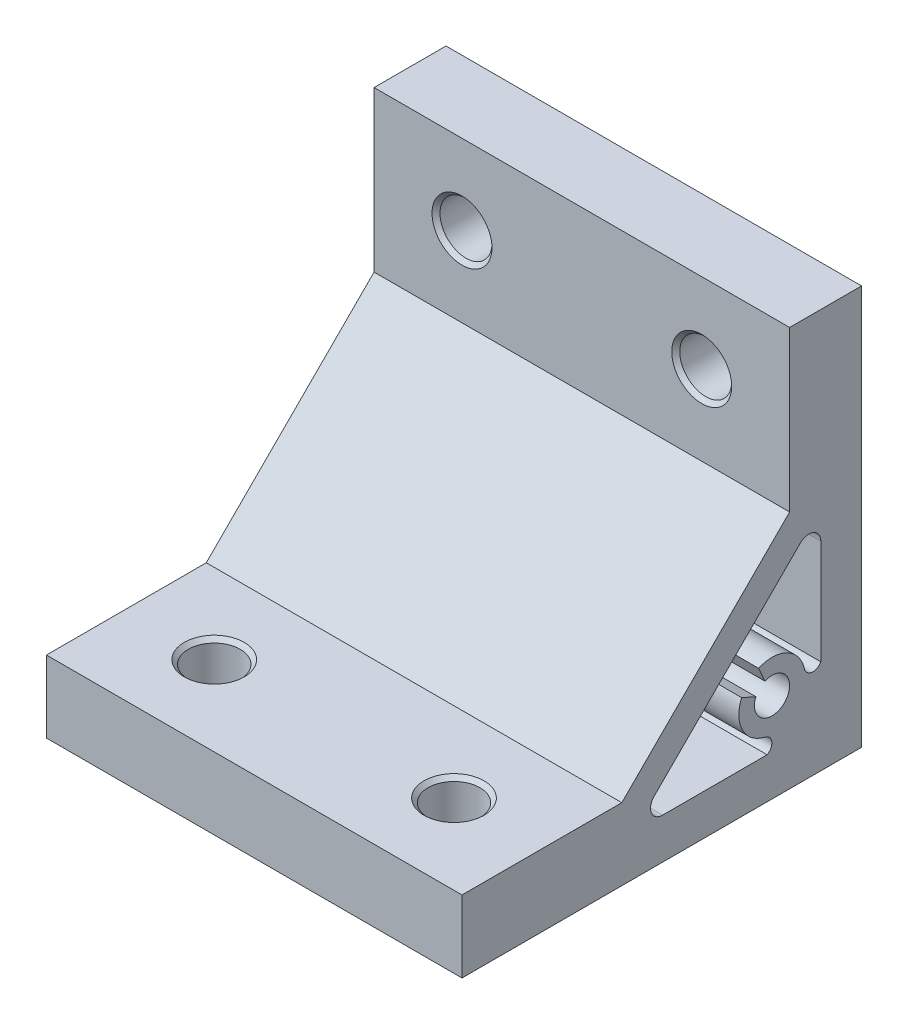
ISO-10303-21;
HEADER;
FILE_DESCRIPTION(('STEP AP214'),'2;1');
FILE_NAME('part.step','',(''),(''),'','','');
FILE_SCHEMA(('AUTOMOTIVE_DESIGN { 1 0 10303 214 1 1 1 1 }'));
ENDSEC;
DATA;
#1=APPLICATION_CONTEXT('core data for automotive mechanical design processes');
#2=APPLICATION_PROTOCOL_DEFINITION('international standard','automotive_design',2000,#1);
#3=PRODUCT_CONTEXT('',#1,'mechanical');
#4=PRODUCT('Part','Part','',(#3));
#5=PRODUCT_RELATED_PRODUCT_CATEGORY('part','',(#4));
#6=PRODUCT_DEFINITION_FORMATION('','',#4);
#7=PRODUCT_DEFINITION_CONTEXT('part definition',#1,'design');
#8=PRODUCT_DEFINITION('design','',#6,#7);
#9=PRODUCT_DEFINITION_SHAPE('','',#8);
#10=(LENGTH_UNIT() NAMED_UNIT(*) SI_UNIT(.MILLI.,.METRE.));
#11=(NAMED_UNIT(*) PLANE_ANGLE_UNIT() SI_UNIT($,.RADIAN.));
#12=(NAMED_UNIT(*) SI_UNIT($,.STERADIAN.) SOLID_ANGLE_UNIT());
#13=UNCERTAINTY_MEASURE_WITH_UNIT(LENGTH_MEASURE(1.E-05),#10,'distance_accuracy_value','');
#14=(GEOMETRIC_REPRESENTATION_CONTEXT(3) GLOBAL_UNCERTAINTY_ASSIGNED_CONTEXT((#13)) GLOBAL_UNIT_ASSIGNED_CONTEXT((#10,
#11,#12)) REPRESENTATION_CONTEXT('',''));
#15=CARTESIAN_POINT('',(0.,0.,0.));
#16=DIRECTION('',(0.,0.,1.));
#17=DIRECTION('',(1.,0.,0.));
#18=AXIS2_PLACEMENT_3D('',#15,#16,#17);
#19=CARTESIAN_POINT('',(15.,9.,25.));
#20=DIRECTION('',(0.,0.,-1.));
#21=DIRECTION('',(0.,1.,0.));
#22=AXIS2_PLACEMENT_3D('',#19,#20,#21);
#23=PLANE('',#22);
#24=DIRECTION('',(0.,-1.,0.));
#25=VECTOR('',#24,1.);
#26=CARTESIAN_POINT('',(-11.,50.,25.));
#27=LINE('',#26,#25);
#28=CARTESIAN_POINT('',(-11.,9.,25.));
#29=VERTEX_POINT('',#28);
#30=CARTESIAN_POINT('',(-11.,0.,25.));
#31=VERTEX_POINT('',#30);
#32=EDGE_CURVE('E39',#29,#31,#27,.T.);
#33=ORIENTED_EDGE('',*,*,#32,.T.);
#34=DIRECTION('',(-1.,0.,0.));
#35=VECTOR('',#34,1.);
#36=CARTESIAN_POINT('',(15.,0.,25.));
#37=LINE('',#36,#35);
#38=CARTESIAN_POINT('',(41.,0.,25.));
#39=VERTEX_POINT('',#38);
#40=EDGE_CURVE('E164',#39,#31,#37,.T.);
#41=ORIENTED_EDGE('',*,*,#40,.F.);
#42=DIRECTION('',(0.,1.,0.));
#43=VECTOR('',#42,1.);
#44=CARTESIAN_POINT('',(41.,50.,25.));
#45=LINE('',#44,#43);
#46=CARTESIAN_POINT('',(41.,9.,25.));
#47=VERTEX_POINT('',#46);
#48=EDGE_CURVE('E155',#39,#47,#45,.T.);
#49=ORIENTED_EDGE('',*,*,#48,.T.);
#50=DIRECTION('',(-1.,0.,0.));
#51=VECTOR('',#50,1.);
#52=CARTESIAN_POINT('',(15.,9.,25.));
#53=LINE('',#52,#51);
#54=EDGE_CURVE('E298',#47,#29,#53,.T.);
#55=ORIENTED_EDGE('',*,*,#54,.T.);
#56=EDGE_LOOP('',(#33,#41,#49,#55));
#57=FACE_BOUND('',#56,.T.);
#58=ADVANCED_FACE('F16',(#57),#23,.F.);
#59=CARTESIAN_POINT('',(15.,0.,25.));
#60=DIRECTION('',(0.,1.,0.));
#61=DIRECTION('',(0.,0.,1.));
#62=AXIS2_PLACEMENT_3D('',#59,#60,#61);
#63=PLANE('',#62);
#64=CARTESIAN_POINT('',(0.,0.,15.));
#65=DIRECTION('',(0.,1.,0.));
#66=DIRECTION('',(0.,0.,1.));
#67=AXIS2_PLACEMENT_3D('',#64,#65,#66);
#68=CIRCLE('',#67,3.75);
#69=CARTESIAN_POINT('',(0.,0.,18.75));
#70=VERTEX_POINT('',#69);
#71=EDGE_CURVE('E188',#70,#70,#68,.T.);
#72=ORIENTED_EDGE('',*,*,#71,.T.);
#73=EDGE_LOOP('',(#72));
#74=FACE_BOUND('',#73,.T.);
#75=CARTESIAN_POINT('',(30.,0.,15.));
#76=DIRECTION('',(0.,-1.,0.));
#77=DIRECTION('',(0.,0.,1.));
#78=AXIS2_PLACEMENT_3D('',#75,#76,#77);
#79=CIRCLE('',#78,3.75);
#80=CARTESIAN_POINT('',(30.,0.,18.75));
#81=VERTEX_POINT('',#80);
#82=EDGE_CURVE('E271',#81,#81,#79,.T.);
#83=ORIENTED_EDGE('',*,*,#82,.F.);
#84=EDGE_LOOP('',(#83));
#85=FACE_BOUND('',#84,.T.);
#86=DIRECTION('',(0.,0.,1.));
#87=VECTOR('',#86,1.);
#88=CARTESIAN_POINT('',(-11.,0.,-25.));
#89=LINE('',#88,#87);
#90=CARTESIAN_POINT('',(-11.,0.,-25.));
#91=VERTEX_POINT('',#90);
#92=EDGE_CURVE('E147',#91,#31,#89,.T.);
#93=ORIENTED_EDGE('',*,*,#92,.F.);
#94=DIRECTION('',(-1.,0.,0.));
#95=VECTOR('',#94,1.);
#96=CARTESIAN_POINT('',(15.,0.,-25.));
#97=LINE('',#96,#95);
#98=CARTESIAN_POINT('',(41.,0.,-25.));
#99=VERTEX_POINT('',#98);
#100=EDGE_CURVE('E162',#99,#91,#97,.T.);
#101=ORIENTED_EDGE('',*,*,#100,.F.);
#102=DIRECTION('',(0.,0.,1.));
#103=VECTOR('',#102,1.);
#104=CARTESIAN_POINT('',(41.,0.,-25.));
#105=LINE('',#104,#103);
#106=EDGE_CURVE('E165',#99,#39,#105,.T.);
#107=ORIENTED_EDGE('',*,*,#106,.T.);
#108=ORIENTED_EDGE('',*,*,#40,.T.);
#109=EDGE_LOOP('',(#93,#101,#107,#108));
#110=FACE_BOUND('',#109,.T.);
#111=ADVANCED_FACE('F160',(#74,#85,#110),#63,.F.);
#112=CARTESIAN_POINT('',(15.,0.,-25.));
#113=DIRECTION('',(0.,0.,1.));
#114=DIRECTION('',(0.,-1.,0.));
#115=AXIS2_PLACEMENT_3D('',#112,#113,#114);
#116=PLANE('',#115);
#117=CARTESIAN_POINT('',(0.,40.,-25.));
#118=DIRECTION('',(0.,0.,1.));
#119=DIRECTION('',(0.,-1.,0.));
#120=AXIS2_PLACEMENT_3D('',#117,#118,#119);
#121=CIRCLE('',#120,3.74999999999999);
#122=CARTESIAN_POINT('',(0.,36.25,-25.));
#123=VERTEX_POINT('',#122);
#124=EDGE_CURVE('E197',#123,#123,#121,.T.);
#125=ORIENTED_EDGE('',*,*,#124,.T.);
#126=EDGE_LOOP('',(#125));
#127=FACE_BOUND('',#126,.T.);
#128=CARTESIAN_POINT('',(30.,40.,-25.));
#129=DIRECTION('',(0.,0.,-1.));
#130=DIRECTION('',(0.,-1.,0.));
#131=AXIS2_PLACEMENT_3D('',#128,#129,#130);
#132=CIRCLE('',#131,3.74999999999999);
#133=CARTESIAN_POINT('',(30.,36.25,-25.));
#134=VERTEX_POINT('',#133);
#135=EDGE_CURVE('E280',#134,#134,#132,.T.);
#136=ORIENTED_EDGE('',*,*,#135,.F.);
#137=EDGE_LOOP('',(#136));
#138=FACE_BOUND('',#137,.T.);
#139=DIRECTION('',(0.,-1.,0.));
#140=VECTOR('',#139,1.);
#141=CARTESIAN_POINT('',(-11.,50.,-25.));
#142=LINE('',#141,#140);
#143=CARTESIAN_POINT('',(-11.,50.,-25.));
#144=VERTEX_POINT('',#143);
#145=EDGE_CURVE('E144',#144,#91,#142,.T.);
#146=ORIENTED_EDGE('',*,*,#145,.F.);
#147=DIRECTION('',(-1.,0.,0.));
#148=VECTOR('',#147,1.);
#149=CARTESIAN_POINT('',(15.,50.,-25.));
#150=LINE('',#149,#148);
#151=CARTESIAN_POINT('',(41.,50.,-25.));
#152=VERTEX_POINT('',#151);
#153=EDGE_CURVE('E169',#152,#144,#150,.T.);
#154=ORIENTED_EDGE('',*,*,#153,.F.);
#155=DIRECTION('',(0.,1.,0.));
#156=VECTOR('',#155,1.);
#157=CARTESIAN_POINT('',(41.,50.,-25.));
#158=LINE('',#157,#156);
#159=EDGE_CURVE('E154',#99,#152,#158,.T.);
#160=ORIENTED_EDGE('',*,*,#159,.F.);
#161=ORIENTED_EDGE('',*,*,#100,.T.);
#162=EDGE_LOOP('',(#146,#154,#160,#161));
#163=FACE_BOUND('',#162,.T.);
#164=ADVANCED_FACE('F168',(#127,#138,#163),#116,.F.);
#165=CARTESIAN_POINT('',(15.,50.,-25.));
#166=DIRECTION('',(0.,-1.,0.));
#167=DIRECTION('',(0.,0.,-1.));
#168=AXIS2_PLACEMENT_3D('',#165,#166,#167);
#169=PLANE('',#168);
#170=DIRECTION('',(0.,0.,1.));
#171=VECTOR('',#170,1.);
#172=CARTESIAN_POINT('',(-11.,50.,-25.));
#173=LINE('',#172,#171);
#174=CARTESIAN_POINT('',(-11.,50.,-16.));
#175=VERTEX_POINT('',#174);
#176=EDGE_CURVE('E149',#144,#175,#173,.T.);
#177=ORIENTED_EDGE('',*,*,#176,.T.);
#178=DIRECTION('',(-1.,0.,0.));
#179=VECTOR('',#178,1.);
#180=CARTESIAN_POINT('',(15.,50.,-16.));
#181=LINE('',#180,#179);
#182=CARTESIAN_POINT('',(41.,50.,-16.));
#183=VERTEX_POINT('',#182);
#184=EDGE_CURVE('E173',#183,#175,#181,.T.);
#185=ORIENTED_EDGE('',*,*,#184,.F.);
#186=DIRECTION('',(0.,0.,1.));
#187=VECTOR('',#186,1.);
#188=CARTESIAN_POINT('',(41.,50.,-25.));
#189=LINE('',#188,#187);
#190=EDGE_CURVE('E335',#152,#183,#189,.T.);
#191=ORIENTED_EDGE('',*,*,#190,.F.);
#192=ORIENTED_EDGE('',*,*,#153,.T.);
#193=EDGE_LOOP('',(#177,#185,#191,#192));
#194=FACE_BOUND('',#193,.T.);
#195=ADVANCED_FACE('F334',(#194),#169,.F.);
#196=CARTESIAN_POINT('',(15.,50.,-16.));
#197=DIRECTION('',(0.,0.,-1.));
#198=DIRECTION('',(0.,1.,0.));
#199=AXIS2_PLACEMENT_3D('',#196,#197,#198);
#200=PLANE('',#199);
#201=CARTESIAN_POINT('',(0.,40.,-16.));
#202=DIRECTION('',(0.,0.,-1.));
#203=DIRECTION('',(0.,1.,0.));
#204=AXIS2_PLACEMENT_3D('',#201,#202,#203);
#205=CIRCLE('',#204,3.75000000000002);
#206=CARTESIAN_POINT('',(0.,43.75,-16.));
#207=VERTEX_POINT('',#206);
#208=EDGE_CURVE('E209',#207,#207,#205,.T.);
#209=ORIENTED_EDGE('',*,*,#208,.T.);
#210=EDGE_LOOP('',(#209));
#211=FACE_BOUND('',#210,.T.);
#212=CARTESIAN_POINT('',(30.,40.,-16.));
#213=DIRECTION('',(0.,0.,1.));
#214=DIRECTION('',(0.,1.,0.));
#215=AXIS2_PLACEMENT_3D('',#212,#213,#214);
#216=CIRCLE('',#215,3.75000000000002);
#217=CARTESIAN_POINT('',(30.,43.75,-16.));
#218=VERTEX_POINT('',#217);
#219=EDGE_CURVE('E292',#218,#218,#216,.T.);
#220=ORIENTED_EDGE('',*,*,#219,.F.);
#221=EDGE_LOOP('',(#220));
#222=FACE_BOUND('',#221,.T.);
#223=DIRECTION('',(0.,1.,0.));
#224=VECTOR('',#223,1.);
#225=CARTESIAN_POINT('',(-11.,50.,-16.));
#226=LINE('',#225,#224);
#227=CARTESIAN_POINT('',(-11.,30.,-16.));
#228=VERTEX_POINT('',#227);
#229=EDGE_CURVE('E269',#228,#175,#226,.T.);
#230=ORIENTED_EDGE('',*,*,#229,.F.);
#231=DIRECTION('',(-1.,0.,0.));
#232=VECTOR('',#231,1.);
#233=CARTESIAN_POINT('',(15.,30.,-16.));
#234=LINE('',#233,#232);
#235=CARTESIAN_POINT('',(41.,30.,-16.));
#236=VERTEX_POINT('',#235);
#237=EDGE_CURVE('E323',#236,#228,#234,.T.);
#238=ORIENTED_EDGE('',*,*,#237,.F.);
#239=DIRECTION('',(0.,-1.,0.));
#240=VECTOR('',#239,1.);
#241=CARTESIAN_POINT('',(41.,50.,-16.));
#242=LINE('',#241,#240);
#243=EDGE_CURVE('E242',#183,#236,#242,.T.);
#244=ORIENTED_EDGE('',*,*,#243,.F.);
#245=ORIENTED_EDGE('',*,*,#184,.T.);
#246=EDGE_LOOP('',(#230,#238,#244,#245));
#247=FACE_BOUND('',#246,.T.);
#248=ADVANCED_FACE('F330',(#211,#222,#247),#200,.F.);
#249=CARTESIAN_POINT('',(15.,30.,-16.));
#250=DIRECTION('',(0.,-0.707106781186547,-0.707106781186548));
#251=DIRECTION('',(0.,0.707106781186548,-0.707106781186547));
#252=AXIS2_PLACEMENT_3D('',#249,#250,#251);
#253=PLANE('',#252);
#254=DIRECTION('',(0.,0.707106781186548,-0.707106781186547));
#255=VECTOR('',#254,1.);
#256=CARTESIAN_POINT('',(-11.,30.,-16.));
#257=LINE('',#256,#255);
#258=CARTESIAN_POINT('',(-11.,9.,5.));
#259=VERTEX_POINT('',#258);
#260=EDGE_CURVE('E267',#259,#228,#257,.T.);
#261=ORIENTED_EDGE('',*,*,#260,.F.);
#262=DIRECTION('',(-1.,0.,0.));
#263=VECTOR('',#262,1.);
#264=CARTESIAN_POINT('',(15.,9.,5.));
#265=LINE('',#264,#263);
#266=CARTESIAN_POINT('',(41.,9.,5.));
#267=VERTEX_POINT('',#266);
#268=EDGE_CURVE('E320',#267,#259,#265,.T.);
#269=ORIENTED_EDGE('',*,*,#268,.F.);
#270=DIRECTION('',(0.,-0.707106781186548,0.707106781186547));
#271=VECTOR('',#270,1.);
#272=CARTESIAN_POINT('',(41.,30.,-16.));
#273=LINE('',#272,#271);
#274=EDGE_CURVE('E31',#236,#267,#273,.T.);
#275=ORIENTED_EDGE('',*,*,#274,.F.);
#276=ORIENTED_EDGE('',*,*,#237,.T.);
#277=EDGE_LOOP('',(#261,#269,#275,#276));
#278=FACE_BOUND('',#277,.T.);
#279=ADVANCED_FACE('F368',(#278),#253,.F.);
#280=CARTESIAN_POINT('',(15.,9.,5.));
#281=DIRECTION('',(0.,-1.,0.));
#282=DIRECTION('',(0.,0.,-1.));
#283=AXIS2_PLACEMENT_3D('',#280,#281,#282);
#284=PLANE('',#283);
#285=CARTESIAN_POINT('',(0.,9.,15.));
#286=DIRECTION('',(0.,-1.,0.));
#287=DIRECTION('',(0.,0.,-1.));
#288=AXIS2_PLACEMENT_3D('',#285,#286,#287);
#289=CIRCLE('',#288,3.75000000000001);
#290=CARTESIAN_POINT('',(0.,9.,11.25));
#291=VERTEX_POINT('',#290);
#292=EDGE_CURVE('E206',#291,#291,#289,.T.);
#293=ORIENTED_EDGE('',*,*,#292,.T.);
#294=EDGE_LOOP('',(#293));
#295=FACE_BOUND('',#294,.T.);
#296=CARTESIAN_POINT('',(30.,9.,15.));
#297=DIRECTION('',(0.,1.,0.));
#298=DIRECTION('',(0.,0.,-1.));
#299=AXIS2_PLACEMENT_3D('',#296,#297,#298);
#300=CIRCLE('',#299,3.75000000000001);
#301=CARTESIAN_POINT('',(30.,9.,11.25));
#302=VERTEX_POINT('',#301);
#303=EDGE_CURVE('E289',#302,#302,#300,.T.);
#304=ORIENTED_EDGE('',*,*,#303,.F.);
#305=EDGE_LOOP('',(#304));
#306=FACE_BOUND('',#305,.T.);
#307=DIRECTION('',(0.,0.,-1.));
#308=VECTOR('',#307,1.);
#309=CARTESIAN_POINT('',(-11.,9.,5.));
#310=LINE('',#309,#308);
#311=EDGE_CURVE('E265',#29,#259,#310,.T.);
#312=ORIENTED_EDGE('',*,*,#311,.F.);
#313=ORIENTED_EDGE('',*,*,#54,.F.);
#314=DIRECTION('',(0.,0.,1.));
#315=VECTOR('',#314,1.);
#316=CARTESIAN_POINT('',(41.,9.,5.));
#317=LINE('',#316,#315);
#318=EDGE_CURVE('E359',#267,#47,#317,.T.);
#319=ORIENTED_EDGE('',*,*,#318,.F.);
#320=ORIENTED_EDGE('',*,*,#268,.T.);
#321=EDGE_LOOP('',(#312,#313,#319,#320));
#322=FACE_BOUND('',#321,.T.);
#323=ADVANCED_FACE('F365',(#295,#306,#322),#284,.F.);
#324=CARTESIAN_POINT('',(0.,40.,-25.));
#325=DIRECTION('',(0.,0.,1.));
#326=DIRECTION('',(1.,0.,0.));
#327=AXIS2_PLACEMENT_3D('',#324,#325,#326);
#328=CYLINDRICAL_SURFACE('',#327,3.25);
#329=CARTESIAN_POINT('',(0.,40.,-24.5));
#330=DIRECTION('',(0.,0.,1.));
#331=DIRECTION('',(1.,0.,0.));
#332=AXIS2_PLACEMENT_3D('',#329,#330,#331);
#333=CIRCLE('',#332,3.25);
#334=CARTESIAN_POINT('',(3.25000000000001,40.,-24.5));
#335=VERTEX_POINT('',#334);
#336=EDGE_CURVE('E203',#335,#335,#333,.F.);
#337=ORIENTED_EDGE('',*,*,#336,.T.);
#338=EDGE_LOOP('',(#337));
#339=FACE_BOUND('',#338,.T.);
#340=CARTESIAN_POINT('',(0.,40.,-16.5));
#341=DIRECTION('',(0.,0.,-1.));
#342=DIRECTION('',(-1.,0.,0.));
#343=AXIS2_PLACEMENT_3D('',#340,#341,#342);
#344=CIRCLE('',#343,3.25);
#345=CARTESIAN_POINT('',(-3.25,40.,-16.5));
#346=VERTEX_POINT('',#345);
#347=EDGE_CURVE('E200',#346,#346,#344,.F.);
#348=ORIENTED_EDGE('',*,*,#347,.T.);
#349=EDGE_LOOP('',(#348));
#350=FACE_BOUND('',#349,.T.);
#351=ADVANCED_FACE('F376',(#339,#350),#328,.F.);
#352=CARTESIAN_POINT('',(0.,0.,15.));
#353=DIRECTION('',(0.,1.,0.));
#354=DIRECTION('',(0.,0.,1.));
#355=AXIS2_PLACEMENT_3D('',#352,#353,#354);
#356=CYLINDRICAL_SURFACE('',#355,3.25);
#357=CARTESIAN_POINT('',(0.,0.500000000000004,15.));
#358=DIRECTION('',(0.,1.,0.));
#359=DIRECTION('',(0.,0.,1.));
#360=AXIS2_PLACEMENT_3D('',#357,#358,#359);
#361=CIRCLE('',#360,3.25);
#362=CARTESIAN_POINT('',(0.,0.500000000000004,18.25));
#363=VERTEX_POINT('',#362);
#364=EDGE_CURVE('E194',#363,#363,#361,.F.);
#365=ORIENTED_EDGE('',*,*,#364,.T.);
#366=EDGE_LOOP('',(#365));
#367=FACE_BOUND('',#366,.T.);
#368=CARTESIAN_POINT('',(0.,8.49999999999999,15.));
#369=DIRECTION('',(0.,-1.,0.));
#370=DIRECTION('',(0.,0.,-1.));
#371=AXIS2_PLACEMENT_3D('',#368,#369,#370);
#372=CIRCLE('',#371,3.25);
#373=CARTESIAN_POINT('',(0.,8.49999999999999,11.75));
#374=VERTEX_POINT('',#373);
#375=EDGE_CURVE('E191',#374,#374,#372,.F.);
#376=ORIENTED_EDGE('',*,*,#375,.T.);
#377=EDGE_LOOP('',(#376));
#378=FACE_BOUND('',#377,.T.);
#379=ADVANCED_FACE('F400',(#367,#378),#356,.F.);
#380=CARTESIAN_POINT('',(0.,0.,15.));
#381=DIRECTION('',(0.,-1.,0.));
#382=DIRECTION('',(0.,0.,-1.));
#383=AXIS2_PLACEMENT_3D('',#380,#381,#382);
#384=CONICAL_SURFACE('',#383,3.75,0.785398163397441);
#385=ORIENTED_EDGE('',*,*,#364,.F.);
#386=EDGE_LOOP('',(#385));
#387=FACE_BOUND('',#386,.T.);
#388=ORIENTED_EDGE('',*,*,#71,.F.);
#389=EDGE_LOOP('',(#388));
#390=FACE_BOUND('',#389,.T.);
#391=ADVANCED_FACE('F396',(#387,#390),#384,.F.);
#392=CARTESIAN_POINT('',(0.,40.,-25.));
#393=DIRECTION('',(0.,0.,-1.));
#394=DIRECTION('',(-1.,0.,0.));
#395=AXIS2_PLACEMENT_3D('',#392,#393,#394);
#396=CONICAL_SURFACE('',#395,3.74999999999999,0.785398163397441);
#397=ORIENTED_EDGE('',*,*,#336,.F.);
#398=EDGE_LOOP('',(#397));
#399=FACE_BOUND('',#398,.T.);
#400=ORIENTED_EDGE('',*,*,#124,.F.);
#401=EDGE_LOOP('',(#400));
#402=FACE_BOUND('',#401,.T.);
#403=ADVANCED_FACE('F399',(#399,#402),#396,.F.);
#404=CARTESIAN_POINT('',(0.,8.49999999999999,15.));
#405=DIRECTION('',(0.,1.,0.));
#406=DIRECTION('',(0.,0.,1.));
#407=AXIS2_PLACEMENT_3D('',#404,#405,#406);
#408=CONICAL_SURFACE('',#407,3.25,0.785398163397445);
#409=ORIENTED_EDGE('',*,*,#292,.F.);
#410=EDGE_LOOP('',(#409));
#411=FACE_BOUND('',#410,.T.);
#412=ORIENTED_EDGE('',*,*,#375,.F.);
#413=EDGE_LOOP('',(#412));
#414=FACE_BOUND('',#413,.T.);
#415=ADVANCED_FACE('F403',(#411,#414),#408,.F.);
#416=CARTESIAN_POINT('',(0.,40.,-16.5));
#417=DIRECTION('',(0.,0.,1.));
#418=DIRECTION('',(1.,0.,0.));
#419=AXIS2_PLACEMENT_3D('',#416,#417,#418);
#420=CONICAL_SURFACE('',#419,3.25,0.785398163397455);
#421=ORIENTED_EDGE('',*,*,#208,.F.);
#422=EDGE_LOOP('',(#421));
#423=FACE_BOUND('',#422,.T.);
#424=ORIENTED_EDGE('',*,*,#347,.F.);
#425=EDGE_LOOP('',(#424));
#426=FACE_BOUND('',#425,.T.);
#427=ADVANCED_FACE('F18',(#423,#426),#420,.F.);
#428=CARTESIAN_POINT('',(30.,40.,-25.));
#429=DIRECTION('',(0.,0.,1.));
#430=DIRECTION('',(-1.,0.,0.));
#431=AXIS2_PLACEMENT_3D('',#428,#429,#430);
#432=CYLINDRICAL_SURFACE('',#431,3.25);
#433=CARTESIAN_POINT('',(30.,40.,-24.5));
#434=DIRECTION('',(0.,0.,-1.));
#435=DIRECTION('',(-1.,0.,0.));
#436=AXIS2_PLACEMENT_3D('',#433,#434,#435);
#437=CIRCLE('',#436,3.25);
#438=CARTESIAN_POINT('',(26.75,40.,-24.5));
#439=VERTEX_POINT('',#438);
#440=EDGE_CURVE('E286',#439,#439,#437,.F.);
#441=ORIENTED_EDGE('',*,*,#440,.F.);
#442=EDGE_LOOP('',(#441));
#443=FACE_BOUND('',#442,.T.);
#444=CARTESIAN_POINT('',(30.,40.,-16.5));
#445=DIRECTION('',(0.,0.,1.));
#446=DIRECTION('',(1.,0.,0.));
#447=AXIS2_PLACEMENT_3D('',#444,#445,#446);
#448=CIRCLE('',#447,3.25);
#449=CARTESIAN_POINT('',(33.25,40.,-16.5));
#450=VERTEX_POINT('',#449);
#451=EDGE_CURVE('E283',#450,#450,#448,.F.);
#452=ORIENTED_EDGE('',*,*,#451,.F.);
#453=EDGE_LOOP('',(#452));
#454=FACE_BOUND('',#453,.T.);
#455=ADVANCED_FACE('F410',(#443,#454),#432,.F.);
#456=CARTESIAN_POINT('',(30.,0.,15.));
#457=DIRECTION('',(0.,1.,0.));
#458=DIRECTION('',(0.,0.,1.));
#459=AXIS2_PLACEMENT_3D('',#456,#457,#458);
#460=CYLINDRICAL_SURFACE('',#459,3.25);
#461=CARTESIAN_POINT('',(30.,0.500000000000004,15.));
#462=DIRECTION('',(0.,-1.,0.));
#463=DIRECTION('',(0.,0.,1.));
#464=AXIS2_PLACEMENT_3D('',#461,#462,#463);
#465=CIRCLE('',#464,3.25);
#466=CARTESIAN_POINT('',(30.,0.500000000000004,18.25));
#467=VERTEX_POINT('',#466);
#468=EDGE_CURVE('E277',#467,#467,#465,.F.);
#469=ORIENTED_EDGE('',*,*,#468,.F.);
#470=EDGE_LOOP('',(#469));
#471=FACE_BOUND('',#470,.T.);
#472=CARTESIAN_POINT('',(30.,8.49999999999999,15.));
#473=DIRECTION('',(0.,1.,0.));
#474=DIRECTION('',(0.,0.,-1.));
#475=AXIS2_PLACEMENT_3D('',#472,#473,#474);
#476=CIRCLE('',#475,3.25);
#477=CARTESIAN_POINT('',(30.,8.49999999999999,11.75));
#478=VERTEX_POINT('',#477);
#479=EDGE_CURVE('E274',#478,#478,#476,.F.);
#480=ORIENTED_EDGE('',*,*,#479,.F.);
#481=EDGE_LOOP('',(#480));
#482=FACE_BOUND('',#481,.T.);
#483=ADVANCED_FACE('F568',(#471,#482),#460,.F.);
#484=CARTESIAN_POINT('',(30.,0.,15.));
#485=DIRECTION('',(0.,-1.,0.));
#486=DIRECTION('',(0.,0.,-1.));
#487=AXIS2_PLACEMENT_3D('',#484,#485,#486);
#488=CONICAL_SURFACE('',#487,3.75,0.785398163397441);
#489=ORIENTED_EDGE('',*,*,#468,.T.);
#490=EDGE_LOOP('',(#489));
#491=FACE_BOUND('',#490,.T.);
#492=ORIENTED_EDGE('',*,*,#82,.T.);
#493=EDGE_LOOP('',(#492));
#494=FACE_BOUND('',#493,.T.);
#495=ADVANCED_FACE('F559',(#491,#494),#488,.F.);
#496=CARTESIAN_POINT('',(30.,40.,-25.));
#497=DIRECTION('',(0.,0.,-1.));
#498=DIRECTION('',(1.,0.,0.));
#499=AXIS2_PLACEMENT_3D('',#496,#497,#498);
#500=CONICAL_SURFACE('',#499,3.74999999999999,0.785398163397441);
#501=ORIENTED_EDGE('',*,*,#440,.T.);
#502=EDGE_LOOP('',(#501));
#503=FACE_BOUND('',#502,.T.);
#504=ORIENTED_EDGE('',*,*,#135,.T.);
#505=EDGE_LOOP('',(#504));
#506=FACE_BOUND('',#505,.T.);
#507=ADVANCED_FACE('F551',(#503,#506),#500,.F.);
#508=CARTESIAN_POINT('',(30.,8.49999999999999,15.));
#509=DIRECTION('',(0.,1.,0.));
#510=DIRECTION('',(0.,0.,1.));
#511=AXIS2_PLACEMENT_3D('',#508,#509,#510);
#512=CONICAL_SURFACE('',#511,3.25,0.785398163397445);
#513=ORIENTED_EDGE('',*,*,#303,.T.);
#514=EDGE_LOOP('',(#513));
#515=FACE_BOUND('',#514,.T.);
#516=ORIENTED_EDGE('',*,*,#479,.T.);
#517=EDGE_LOOP('',(#516));
#518=FACE_BOUND('',#517,.T.);
#519=ADVANCED_FACE('F543',(#515,#518),#512,.F.);
#520=CARTESIAN_POINT('',(30.,40.,-16.5));
#521=DIRECTION('',(0.,0.,1.));
#522=DIRECTION('',(-1.,0.,0.));
#523=AXIS2_PLACEMENT_3D('',#520,#521,#522);
#524=CONICAL_SURFACE('',#523,3.25,0.785398163397455);
#525=ORIENTED_EDGE('',*,*,#219,.T.);
#526=EDGE_LOOP('',(#525));
#527=FACE_BOUND('',#526,.T.);
#528=ORIENTED_EDGE('',*,*,#451,.T.);
#529=EDGE_LOOP('',(#528));
#530=FACE_BOUND('',#529,.T.);
#531=ADVANCED_FACE('F425',(#527,#530),#524,.F.);
#532=CARTESIAN_POINT('',(41.,50.,-25.));
#533=DIRECTION('',(1.,0.,0.));
#534=DIRECTION('',(0.,1.,0.));
#535=AXIS2_PLACEMENT_3D('',#532,#533,#534);
#536=PLANE('',#535);
#537=CARTESIAN_POINT('',(41.,24.9046681194226,-18.4));
#538=DIRECTION('',(1.,0.,0.));
#539=DIRECTION('',(0.,1.,0.));
#540=AXIS2_PLACEMENT_3D('',#537,#538,#539);
#541=CIRCLE('',#540,1.5);
#542=CARTESIAN_POINT('',(41.,25.9653282912024,-17.3393398282202));
#543=VERTEX_POINT('',#542);
#544=CARTESIAN_POINT('',(41.,24.9046681194226,-19.9));
#545=VERTEX_POINT('',#544);
#546=EDGE_CURVE('E226',#543,#545,#541,.F.);
#547=ORIENTED_EDGE('',*,*,#546,.T.);
#548=DIRECTION('',(0.,-1.,0.));
#549=VECTOR('',#548,1.);
#550=CARTESIAN_POINT('',(41.,11.8175144212722,-19.9));
#551=LINE('',#550,#549);
#552=CARTESIAN_POINT('',(41.,11.8175144212722,-19.9));
#553=VERTEX_POINT('',#552);
#554=EDGE_CURVE('E227',#545,#553,#551,.T.);
#555=ORIENTED_EDGE('',*,*,#554,.T.);
#556=CARTESIAN_POINT('',(41.,12.3315574267284,-18.9238670543259));
#557=DIRECTION('',(1.,0.,0.));
#558=DIRECTION('',(0.,1.,0.));
#559=AXIS2_PLACEMENT_3D('',#556,#557,#558);
#560=CIRCLE('',#559,1.10321155681434);
#561=CARTESIAN_POINT('',(41.,12.1057315128375,-17.8440159554683));
#562=VERTEX_POINT('',#561);
#563=EDGE_CURVE('E355',#553,#562,#560,.F.);
#564=ORIENTED_EDGE('',*,*,#563,.T.);
#565=CARTESIAN_POINT('',(41.,11.2076424818068,-13.7923575181932));
#566=DIRECTION('',(1.,0.,0.));
#567=DIRECTION('',(0.,1.,0.));
#568=AXIS2_PLACEMENT_3D('',#565,#566,#567);
#569=CIRCLE('',#568,4.15);
#570=CARTESIAN_POINT('',(41.,15.0044038944035,-12.1169164491561));
#571=VERTEX_POINT('',#570);
#572=EDGE_CURVE('E353',#562,#571,#569,.T.);
#573=ORIENTED_EDGE('',*,*,#572,.T.);
#574=DIRECTION('',(0.,-0.914882268095604,-0.403720739527019));
#575=VECTOR('',#574,1.);
#576=CARTESIAN_POINT('',(41.,15.0044038944035,-12.1169164491561));
#577=LINE('',#576,#575);
#578=CARTESIAN_POINT('',(41.,13.2203834716171,-12.9041718912338));
#579=VERTEX_POINT('',#578);
#580=EDGE_CURVE('E351',#571,#579,#577,.T.);
#581=ORIENTED_EDGE('',*,*,#580,.T.);
#582=CARTESIAN_POINT('',(41.,11.2076424818068,-13.7923575181932));
#583=DIRECTION('',(1.,0.,0.));
#584=DIRECTION('',(0.,1.,0.));
#585=AXIS2_PLACEMENT_3D('',#582,#583,#584);
#586=CIRCLE('',#585,2.2);
#587=CARTESIAN_POINT('',(41.,12.0958281087662,-11.7796165283829));
#588=VERTEX_POINT('',#587);
#589=EDGE_CURVE('E349',#579,#588,#586,.F.);
#590=ORIENTED_EDGE('',*,*,#589,.T.);
#591=DIRECTION('',(0.,0.403720739527014,0.914882268095606));
#592=VECTOR('',#591,1.);
#593=CARTESIAN_POINT('',(41.,12.8830835508439,-9.99559610559647));
#594=LINE('',#593,#592);
#595=CARTESIAN_POINT('',(41.,12.8830835508439,-9.99559610559646));
#596=VERTEX_POINT('',#595);
#597=EDGE_CURVE('E347',#588,#596,#594,.T.);
#598=ORIENTED_EDGE('',*,*,#597,.T.);
#599=CARTESIAN_POINT('',(41.,11.2076424818068,-13.7923575181932));
#600=DIRECTION('',(1.,0.,0.));
#601=DIRECTION('',(0.,1.,0.));
#602=AXIS2_PLACEMENT_3D('',#599,#600,#601);
#603=CIRCLE('',#602,4.15);
#604=CARTESIAN_POINT('',(41.,7.15598404453171,-12.8942684871625));
#605=VERTEX_POINT('',#604);
#606=EDGE_CURVE('E345',#596,#605,#603,.T.);
#607=ORIENTED_EDGE('',*,*,#606,.T.);
#608=CARTESIAN_POINT('',(41.,6.07613294567405,-12.6684425732716));
#609=DIRECTION('',(1.,0.,0.));
#610=DIRECTION('',(0.,1.,0.));
#611=AXIS2_PLACEMENT_3D('',#608,#609,#610);
#612=CIRCLE('',#611,1.10321155681434);
#613=CARTESIAN_POINT('',(41.,5.1,-13.1824855787278));
#614=VERTEX_POINT('',#613);
#615=EDGE_CURVE('E337',#605,#614,#612,.F.);
#616=ORIENTED_EDGE('',*,*,#615,.T.);
#617=DIRECTION('',(0.,0.,1.));
#618=VECTOR('',#617,1.);
#619=CARTESIAN_POINT('',(41.,5.1,3.52598846298224));
#620=LINE('',#619,#618);
#621=CARTESIAN_POINT('',(41.,5.1,-0.0953318805774003));
#622=VERTEX_POINT('',#621);
#623=EDGE_CURVE('E218',#614,#622,#620,.T.);
#624=ORIENTED_EDGE('',*,*,#623,.T.);
#625=CARTESIAN_POINT('',(41.,6.6,-0.0953318805774006));
#626=DIRECTION('',(1.,0.,0.));
#627=DIRECTION('',(0.,1.,0.));
#628=AXIS2_PLACEMENT_3D('',#625,#626,#627);
#629=CIRCLE('',#628,1.5);
#630=CARTESIAN_POINT('',(41.,7.66066017177983,0.965328291202417));
#631=VERTEX_POINT('',#630);
#632=EDGE_CURVE('E24',#622,#631,#629,.F.);
#633=ORIENTED_EDGE('',*,*,#632,.T.);
#634=DIRECTION('',(0.,0.707106781186548,-0.707106781186548));
#635=VECTOR('',#634,1.);
#636=CARTESIAN_POINT('',(41.,28.5259884629822,-19.9));
#637=LINE('',#636,#635);
#638=EDGE_CURVE('E215',#631,#543,#637,.T.);
#639=ORIENTED_EDGE('',*,*,#638,.T.);
#640=EDGE_LOOP('',(#547,#555,#564,#573,#581,#590,#598,#607,#616,#624,#633,#639));
#641=FACE_BOUND('',#640,.T.);
#642=ORIENTED_EDGE('',*,*,#243,.T.);
#643=ORIENTED_EDGE('',*,*,#274,.T.);
#644=ORIENTED_EDGE('',*,*,#318,.T.);
#645=ORIENTED_EDGE('',*,*,#48,.F.);
#646=ORIENTED_EDGE('',*,*,#106,.F.);
#647=ORIENTED_EDGE('',*,*,#159,.T.);
#648=ORIENTED_EDGE('',*,*,#190,.T.);
#649=EDGE_LOOP('',(#642,#643,#644,#645,#646,#647,#648));
#650=FACE_BOUND('',#649,.T.);
#651=ADVANCED_FACE('F214',(#641,#650),#536,.T.);
#652=CARTESIAN_POINT('',(-11.,50.,-25.));
#653=DIRECTION('',(-1.,0.,0.));
#654=DIRECTION('',(0.,-1.,0.));
#655=AXIS2_PLACEMENT_3D('',#652,#653,#654);
#656=PLANE('',#655);
#657=CARTESIAN_POINT('',(-11.,24.9046681194226,-18.4));
#658=DIRECTION('',(-1.,0.,0.));
#659=DIRECTION('',(0.,-1.,0.));
#660=AXIS2_PLACEMENT_3D('',#657,#658,#659);
#661=CIRCLE('',#660,1.5);
#662=CARTESIAN_POINT('',(-11.,24.9046681194226,-19.9));
#663=VERTEX_POINT('',#662);
#664=CARTESIAN_POINT('',(-11.,25.9653282912024,-17.3393398282202));
#665=VERTEX_POINT('',#664);
#666=EDGE_CURVE('E263',#663,#665,#661,.F.);
#667=ORIENTED_EDGE('',*,*,#666,.T.);
#668=DIRECTION('',(0.,-0.707106781186548,0.707106781186548));
#669=VECTOR('',#668,1.);
#670=CARTESIAN_POINT('',(-11.,28.5259884629822,-19.9));
#671=LINE('',#670,#669);
#672=CARTESIAN_POINT('',(-11.,7.66066017177982,0.96532829120242));
#673=VERTEX_POINT('',#672);
#674=EDGE_CURVE('E235',#665,#673,#671,.T.);
#675=ORIENTED_EDGE('',*,*,#674,.T.);
#676=CARTESIAN_POINT('',(-11.,6.6,-0.0953318805774006));
#677=DIRECTION('',(-1.,0.,0.));
#678=DIRECTION('',(0.,-1.,0.));
#679=AXIS2_PLACEMENT_3D('',#676,#677,#678);
#680=CIRCLE('',#679,1.5);
#681=CARTESIAN_POINT('',(-11.,5.1,-0.0953318805774006));
#682=VERTEX_POINT('',#681);
#683=EDGE_CURVE('E10',#673,#682,#680,.F.);
#684=ORIENTED_EDGE('',*,*,#683,.T.);
#685=DIRECTION('',(0.,0.,-1.));
#686=VECTOR('',#685,1.);
#687=CARTESIAN_POINT('',(-11.,5.1,3.52598846298224));
#688=LINE('',#687,#686);
#689=CARTESIAN_POINT('',(-11.,5.1,-13.1824855787278));
#690=VERTEX_POINT('',#689);
#691=EDGE_CURVE('E233',#682,#690,#688,.T.);
#692=ORIENTED_EDGE('',*,*,#691,.T.);
#693=CARTESIAN_POINT('',(-11.,6.07613294567405,-12.6684425732716));
#694=DIRECTION('',(-1.,0.,0.));
#695=DIRECTION('',(0.,-1.,0.));
#696=AXIS2_PLACEMENT_3D('',#693,#694,#695);
#697=CIRCLE('',#696,1.10321155681434);
#698=CARTESIAN_POINT('',(-11.,7.15598404453171,-12.8942684871625));
#699=VERTEX_POINT('',#698);
#700=EDGE_CURVE('E241',#690,#699,#697,.F.);
#701=ORIENTED_EDGE('',*,*,#700,.T.);
#702=CARTESIAN_POINT('',(-11.,11.2076424818068,-13.7923575181932));
#703=DIRECTION('',(-1.,0.,0.));
#704=DIRECTION('',(0.,-1.,0.));
#705=AXIS2_PLACEMENT_3D('',#702,#703,#704);
#706=CIRCLE('',#705,4.15);
#707=CARTESIAN_POINT('',(-11.,12.8830835508439,-9.99559610559646));
#708=VERTEX_POINT('',#707);
#709=EDGE_CURVE('E244',#699,#708,#706,.T.);
#710=ORIENTED_EDGE('',*,*,#709,.T.);
#711=DIRECTION('',(0.,-0.403720739527014,-0.914882268095606));
#712=VECTOR('',#711,1.);
#713=CARTESIAN_POINT('',(-11.,12.8830835508439,-9.99559610559646));
#714=LINE('',#713,#712);
#715=CARTESIAN_POINT('',(-11.,12.0958281087662,-11.7796165283829));
#716=VERTEX_POINT('',#715);
#717=EDGE_CURVE('E250',#708,#716,#714,.T.);
#718=ORIENTED_EDGE('',*,*,#717,.T.);
#719=CARTESIAN_POINT('',(-11.,11.2076424818068,-13.7923575181932));
#720=DIRECTION('',(-1.,0.,0.));
#721=DIRECTION('',(0.,-1.,0.));
#722=AXIS2_PLACEMENT_3D('',#719,#720,#721);
#723=CIRCLE('',#722,2.2);
#724=CARTESIAN_POINT('',(-11.,13.2203834716171,-12.9041718912338));
#725=VERTEX_POINT('',#724);
#726=EDGE_CURVE('E252',#716,#725,#723,.F.);
#727=ORIENTED_EDGE('',*,*,#726,.T.);
#728=DIRECTION('',(0.,0.914882268095604,0.403720739527019));
#729=VECTOR('',#728,1.);
#730=CARTESIAN_POINT('',(-11.,15.0044038944035,-12.1169164491561));
#731=LINE('',#730,#729);
#732=CARTESIAN_POINT('',(-11.,15.0044038944035,-12.1169164491561));
#733=VERTEX_POINT('',#732);
#734=EDGE_CURVE('E254',#725,#733,#731,.T.);
#735=ORIENTED_EDGE('',*,*,#734,.T.);
#736=CARTESIAN_POINT('',(-11.,11.2076424818068,-13.7923575181932));
#737=DIRECTION('',(-1.,0.,0.));
#738=DIRECTION('',(0.,-1.,0.));
#739=AXIS2_PLACEMENT_3D('',#736,#737,#738);
#740=CIRCLE('',#739,4.15);
#741=CARTESIAN_POINT('',(-11.,12.1057315128375,-17.8440159554683));
#742=VERTEX_POINT('',#741);
#743=EDGE_CURVE('E256',#733,#742,#740,.T.);
#744=ORIENTED_EDGE('',*,*,#743,.T.);
#745=CARTESIAN_POINT('',(-11.,12.3315574267284,-18.9238670543259));
#746=DIRECTION('',(-1.,0.,0.));
#747=DIRECTION('',(0.,-1.,0.));
#748=AXIS2_PLACEMENT_3D('',#745,#746,#747);
#749=CIRCLE('',#748,1.10321155681434);
#750=CARTESIAN_POINT('',(-11.,11.8175144212722,-19.9));
#751=VERTEX_POINT('',#750);
#752=EDGE_CURVE('E258',#742,#751,#749,.F.);
#753=ORIENTED_EDGE('',*,*,#752,.T.);
#754=DIRECTION('',(0.,1.,0.));
#755=VECTOR('',#754,1.);
#756=CARTESIAN_POINT('',(-11.,11.8175144212722,-19.9));
#757=LINE('',#756,#755);
#758=EDGE_CURVE('E260',#751,#663,#757,.T.);
#759=ORIENTED_EDGE('',*,*,#758,.T.);
#760=EDGE_LOOP('',(#667,#675,#684,#692,#701,#710,#718,#727,#735,#744,#753,#759));
#761=FACE_BOUND('',#760,.T.);
#762=ORIENTED_EDGE('',*,*,#229,.T.);
#763=ORIENTED_EDGE('',*,*,#176,.F.);
#764=ORIENTED_EDGE('',*,*,#145,.T.);
#765=ORIENTED_EDGE('',*,*,#92,.T.);
#766=ORIENTED_EDGE('',*,*,#32,.F.);
#767=ORIENTED_EDGE('',*,*,#311,.T.);
#768=ORIENTED_EDGE('',*,*,#260,.T.);
#769=EDGE_LOOP('',(#762,#763,#764,#765,#766,#767,#768));
#770=FACE_BOUND('',#769,.T.);
#771=ADVANCED_FACE('F146',(#761,#770),#656,.T.);
#772=CARTESIAN_POINT('',(-15.,24.9046681194226,-18.4));
#773=DIRECTION('',(-1.,0.,0.));
#774=DIRECTION('',(0.,0.,1.));
#775=AXIS2_PLACEMENT_3D('',#772,#773,#774);
#776=CYLINDRICAL_SURFACE('',#775,1.5);
#777=ORIENTED_EDGE('',*,*,#666,.F.);
#778=DIRECTION('',(1.,0.,0.));
#779=VECTOR('',#778,1.);
#780=CARTESIAN_POINT('',(-15.,24.9046681194226,-19.9));
#781=LINE('',#780,#779);
#782=EDGE_CURVE('E182',#545,#663,#781,.F.);
#783=ORIENTED_EDGE('',*,*,#782,.F.);
#784=ORIENTED_EDGE('',*,*,#546,.F.);
#785=DIRECTION('',(1.,0.,0.));
#786=VECTOR('',#785,1.);
#787=CARTESIAN_POINT('',(15.,25.9653282912024,-17.3393398282202));
#788=LINE('',#787,#786);
#789=EDGE_CURVE('E179',#665,#543,#788,.T.);
#790=ORIENTED_EDGE('',*,*,#789,.F.);
#791=EDGE_LOOP('',(#777,#783,#784,#790));
#792=FACE_BOUND('',#791,.T.);
#793=ADVANCED_FACE('F390',(#792),#776,.F.);
#794=CARTESIAN_POINT('',(-15.,6.6,-0.0953318805774006));
#795=DIRECTION('',(-1.,0.,0.));
#796=DIRECTION('',(0.,0.,1.));
#797=AXIS2_PLACEMENT_3D('',#794,#795,#796);
#798=CYLINDRICAL_SURFACE('',#797,1.5);
#799=ORIENTED_EDGE('',*,*,#683,.F.);
#800=DIRECTION('',(1.,0.,0.));
#801=VECTOR('',#800,1.);
#802=CARTESIAN_POINT('',(-15.,7.66066017177982,0.96532829120242));
#803=LINE('',#802,#801);
#804=EDGE_CURVE('E171',#631,#673,#803,.F.);
#805=ORIENTED_EDGE('',*,*,#804,.F.);
#806=ORIENTED_EDGE('',*,*,#632,.F.);
#807=DIRECTION('',(1.,0.,0.));
#808=VECTOR('',#807,1.);
#809=CARTESIAN_POINT('',(15.,5.1,-0.0953318805774003));
#810=LINE('',#809,#808);
#811=EDGE_CURVE('E185',#682,#622,#810,.T.);
#812=ORIENTED_EDGE('',*,*,#811,.F.);
#813=EDGE_LOOP('',(#799,#805,#806,#812));
#814=FACE_BOUND('',#813,.T.);
#815=ADVANCED_FACE('F230',(#814),#798,.F.);
#816=CARTESIAN_POINT('',(-15.,5.1,3.52598846298224));
#817=DIRECTION('',(0.,-1.,0.));
#818=DIRECTION('',(0.,0.,-1.));
#819=AXIS2_PLACEMENT_3D('',#816,#817,#818);
#820=PLANE('',#819);
#821=ORIENTED_EDGE('',*,*,#691,.F.);
#822=ORIENTED_EDGE('',*,*,#811,.T.);
#823=ORIENTED_EDGE('',*,*,#623,.F.);
#824=DIRECTION('',(1.,0.,0.));
#825=VECTOR('',#824,1.);
#826=CARTESIAN_POINT('',(-15.,5.1,-13.1824855787278));
#827=LINE('',#826,#825);
#828=EDGE_CURVE('E240',#690,#614,#827,.T.);
#829=ORIENTED_EDGE('',*,*,#828,.F.);
#830=EDGE_LOOP('',(#821,#822,#823,#829));
#831=FACE_BOUND('',#830,.T.);
#832=ADVANCED_FACE('F238',(#831),#820,.F.);
#833=CARTESIAN_POINT('',(-15.,6.07613294567405,-12.6684425732716));
#834=DIRECTION('',(1.,0.,0.));
#835=DIRECTION('',(0.,0.,-1.));
#836=AXIS2_PLACEMENT_3D('',#833,#834,#835);
#837=CYLINDRICAL_SURFACE('',#836,1.10321155681434);
#838=ORIENTED_EDGE('',*,*,#700,.F.);
#839=ORIENTED_EDGE('',*,*,#828,.T.);
#840=ORIENTED_EDGE('',*,*,#615,.F.);
#841=DIRECTION('',(1.,0.,0.));
#842=VECTOR('',#841,1.);
#843=CARTESIAN_POINT('',(-15.,7.15598404453171,-12.8942684871625));
#844=LINE('',#843,#842);
#845=EDGE_CURVE('E314',#699,#605,#844,.T.);
#846=ORIENTED_EDGE('',*,*,#845,.F.);
#847=EDGE_LOOP('',(#838,#839,#840,#846));
#848=FACE_BOUND('',#847,.T.);
#849=ADVANCED_FACE('F455',(#848),#837,.F.);
#850=CARTESIAN_POINT('',(-15.,11.2076424818068,-13.7923575181932));
#851=DIRECTION('',(1.,0.,0.));
#852=DIRECTION('',(0.,0.,-1.));
#853=AXIS2_PLACEMENT_3D('',#850,#851,#852);
#854=CYLINDRICAL_SURFACE('',#853,4.15);
#855=ORIENTED_EDGE('',*,*,#709,.F.);
#856=ORIENTED_EDGE('',*,*,#845,.T.);
#857=ORIENTED_EDGE('',*,*,#606,.F.);
#858=DIRECTION('',(1.,0.,0.));
#859=VECTOR('',#858,1.);
#860=CARTESIAN_POINT('',(-15.,12.8830835508439,-9.99559610559646));
#861=LINE('',#860,#859);
#862=EDGE_CURVE('E311',#708,#596,#861,.T.);
#863=ORIENTED_EDGE('',*,*,#862,.F.);
#864=EDGE_LOOP('',(#855,#856,#857,#863));
#865=FACE_BOUND('',#864,.T.);
#866=ADVANCED_FACE('F451',(#865),#854,.T.);
#867=CARTESIAN_POINT('',(-15.,12.8830835508439,-9.99559610559646));
#868=DIRECTION('',(0.,-0.914882268095606,0.403720739527014));
#869=DIRECTION('',(0.,-0.403720739527014,-0.914882268095606));
#870=AXIS2_PLACEMENT_3D('',#867,#868,#869);
#871=PLANE('',#870);
#872=ORIENTED_EDGE('',*,*,#717,.F.);
#873=ORIENTED_EDGE('',*,*,#862,.T.);
#874=ORIENTED_EDGE('',*,*,#597,.F.);
#875=DIRECTION('',(1.,0.,0.));
#876=VECTOR('',#875,1.);
#877=CARTESIAN_POINT('',(-15.,12.0958281087662,-11.7796165283829));
#878=LINE('',#877,#876);
#879=EDGE_CURVE('E308',#716,#588,#878,.T.);
#880=ORIENTED_EDGE('',*,*,#879,.F.);
#881=EDGE_LOOP('',(#872,#873,#874,#880));
#882=FACE_BOUND('',#881,.T.);
#883=ADVANCED_FACE('F447',(#882),#871,.F.);
#884=CARTESIAN_POINT('',(-15.,11.2076424818068,-13.7923575181932));
#885=DIRECTION('',(1.,0.,0.));
#886=DIRECTION('',(0.,0.,-1.));
#887=AXIS2_PLACEMENT_3D('',#884,#885,#886);
#888=CYLINDRICAL_SURFACE('',#887,2.2);
#889=ORIENTED_EDGE('',*,*,#726,.F.);
#890=ORIENTED_EDGE('',*,*,#879,.T.);
#891=ORIENTED_EDGE('',*,*,#589,.F.);
#892=DIRECTION('',(1.,0.,0.));
#893=VECTOR('',#892,1.);
#894=CARTESIAN_POINT('',(-15.,13.2203834716171,-12.9041718912338));
#895=LINE('',#894,#893);
#896=EDGE_CURVE('E305',#725,#579,#895,.T.);
#897=ORIENTED_EDGE('',*,*,#896,.F.);
#898=EDGE_LOOP('',(#889,#890,#891,#897));
#899=FACE_BOUND('',#898,.T.);
#900=ADVANCED_FACE('F443',(#899),#888,.F.);
#901=CARTESIAN_POINT('',(-15.,15.0044038944035,-12.1169164491561));
#902=DIRECTION('',(0.,0.403720739527019,-0.914882268095604));
#903=DIRECTION('',(0.,0.914882268095604,0.403720739527019));
#904=AXIS2_PLACEMENT_3D('',#901,#902,#903);
#905=PLANE('',#904);
#906=ORIENTED_EDGE('',*,*,#734,.F.);
#907=ORIENTED_EDGE('',*,*,#896,.T.);
#908=ORIENTED_EDGE('',*,*,#580,.F.);
#909=DIRECTION('',(1.,0.,0.));
#910=VECTOR('',#909,1.);
#911=CARTESIAN_POINT('',(-15.,15.0044038944035,-12.1169164491561));
#912=LINE('',#911,#910);
#913=EDGE_CURVE('E302',#733,#571,#912,.T.);
#914=ORIENTED_EDGE('',*,*,#913,.F.);
#915=EDGE_LOOP('',(#906,#907,#908,#914));
#916=FACE_BOUND('',#915,.T.);
#917=ADVANCED_FACE('F439',(#916),#905,.F.);
#918=CARTESIAN_POINT('',(-15.,11.2076424818068,-13.7923575181932));
#919=DIRECTION('',(1.,0.,0.));
#920=DIRECTION('',(0.,0.,-1.));
#921=AXIS2_PLACEMENT_3D('',#918,#919,#920);
#922=CYLINDRICAL_SURFACE('',#921,4.15);
#923=ORIENTED_EDGE('',*,*,#743,.F.);
#924=ORIENTED_EDGE('',*,*,#913,.T.);
#925=ORIENTED_EDGE('',*,*,#572,.F.);
#926=DIRECTION('',(1.,0.,0.));
#927=VECTOR('',#926,1.);
#928=CARTESIAN_POINT('',(-15.,12.1057315128375,-17.8440159554683));
#929=LINE('',#928,#927);
#930=EDGE_CURVE('E299',#742,#562,#929,.T.);
#931=ORIENTED_EDGE('',*,*,#930,.F.);
#932=EDGE_LOOP('',(#923,#924,#925,#931));
#933=FACE_BOUND('',#932,.T.);
#934=ADVANCED_FACE('F435',(#933),#922,.T.);
#935=CARTESIAN_POINT('',(-15.,12.3315574267284,-18.9238670543259));
#936=DIRECTION('',(1.,0.,0.));
#937=DIRECTION('',(0.,0.,-1.));
#938=AXIS2_PLACEMENT_3D('',#935,#936,#937);
#939=CYLINDRICAL_SURFACE('',#938,1.10321155681434);
#940=ORIENTED_EDGE('',*,*,#752,.F.);
#941=ORIENTED_EDGE('',*,*,#930,.T.);
#942=ORIENTED_EDGE('',*,*,#563,.F.);
#943=DIRECTION('',(1.,0.,0.));
#944=VECTOR('',#943,1.);
#945=CARTESIAN_POINT('',(-15.,11.8175144212722,-19.9));
#946=LINE('',#945,#944);
#947=EDGE_CURVE('E295',#751,#553,#946,.T.);
#948=ORIENTED_EDGE('',*,*,#947,.F.);
#949=EDGE_LOOP('',(#940,#941,#942,#948));
#950=FACE_BOUND('',#949,.T.);
#951=ADVANCED_FACE('F431',(#950),#939,.F.);
#952=CARTESIAN_POINT('',(-15.,11.8175144212722,-19.9));
#953=DIRECTION('',(0.,0.,-1.));
#954=DIRECTION('',(0.,1.,0.));
#955=AXIS2_PLACEMENT_3D('',#952,#953,#954);
#956=PLANE('',#955);
#957=ORIENTED_EDGE('',*,*,#758,.F.);
#958=ORIENTED_EDGE('',*,*,#947,.T.);
#959=ORIENTED_EDGE('',*,*,#554,.F.);
#960=ORIENTED_EDGE('',*,*,#782,.T.);
#961=EDGE_LOOP('',(#957,#958,#959,#960));
#962=FACE_BOUND('',#961,.T.);
#963=ADVANCED_FACE('F428',(#962),#956,.F.);
#964=CARTESIAN_POINT('',(-15.,28.5259884629822,-19.9));
#965=DIRECTION('',(0.,0.707106781186547,0.707106781186547));
#966=DIRECTION('',(0.,-0.707106781186548,0.707106781186548));
#967=AXIS2_PLACEMENT_3D('',#964,#965,#966);
#968=PLANE('',#967);
#969=ORIENTED_EDGE('',*,*,#674,.F.);
#970=ORIENTED_EDGE('',*,*,#789,.T.);
#971=ORIENTED_EDGE('',*,*,#638,.F.);
#972=ORIENTED_EDGE('',*,*,#804,.T.);
#973=EDGE_LOOP('',(#969,#970,#971,#972));
#974=FACE_BOUND('',#973,.T.);
#975=ADVANCED_FACE('F224',(#974),#968,.F.);
#976=CLOSED_SHELL('',(#58,#111,#164,#195,#248,#279,#323,#351,#379,#391,#403,#415,#427,#455,#483,
#495,#507,#519,#531,#651,#771,#793,#815,#832,#849,#866,#883,#900,#917,#934,#951,#963,#975));
#977=MANIFOLD_SOLID_BREP('B1',#976);
#978=ADVANCED_BREP_SHAPE_REPRESENTATION('',(#18,#977),#14);
#979=SHAPE_DEFINITION_REPRESENTATION(#9,#978);
ENDSEC;
END-ISO-10303-21;
